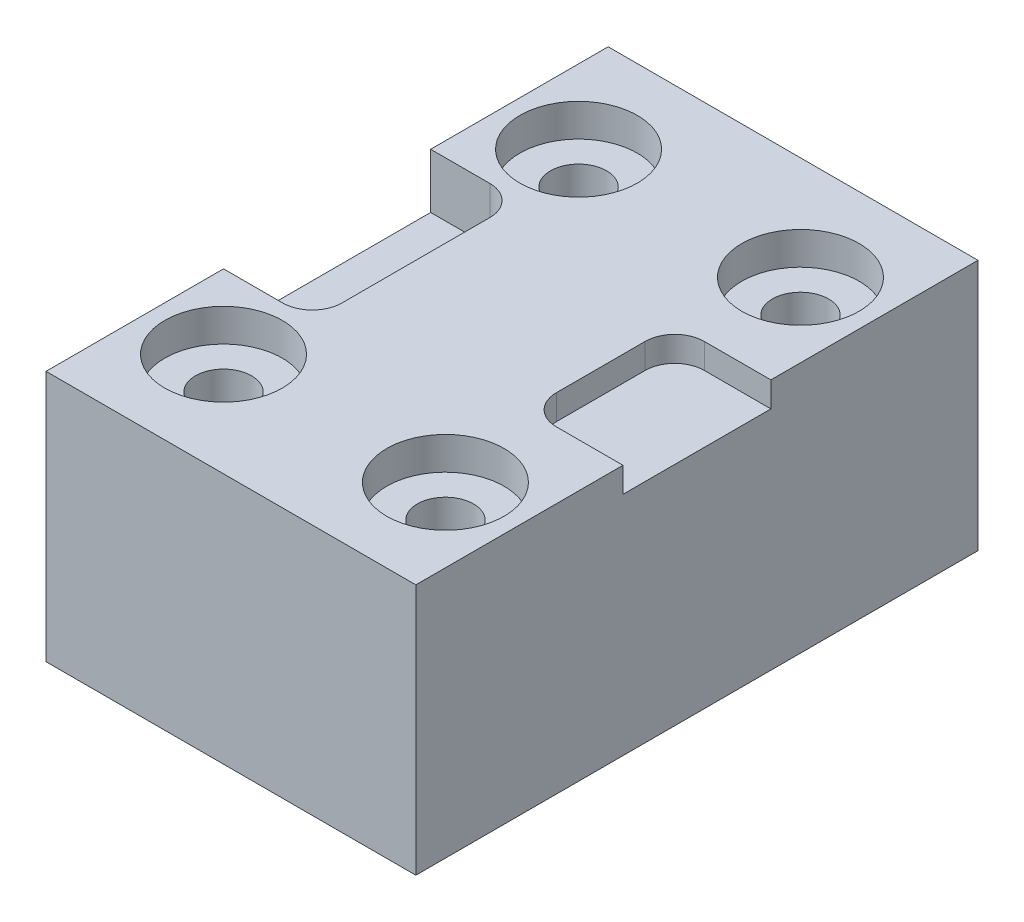
ISO-10303-21;
HEADER;
FILE_DESCRIPTION(('STEP AP214'),'2;1');
FILE_NAME('part.step','',(''),(''),'','','');
FILE_SCHEMA(('AUTOMOTIVE_DESIGN { 1 0 10303 214 1 1 1 1 }'));
ENDSEC;
DATA;
#1=APPLICATION_CONTEXT('core data for automotive mechanical design processes');
#2=APPLICATION_PROTOCOL_DEFINITION('international standard','automotive_design',2000,#1);
#3=PRODUCT_CONTEXT('',#1,'mechanical');
#4=PRODUCT('Part','Part','',(#3));
#5=PRODUCT_RELATED_PRODUCT_CATEGORY('part','',(#4));
#6=PRODUCT_DEFINITION_FORMATION('','',#4);
#7=PRODUCT_DEFINITION_CONTEXT('part definition',#1,'design');
#8=PRODUCT_DEFINITION('design','',#6,#7);
#9=PRODUCT_DEFINITION_SHAPE('','',#8);
#10=(LENGTH_UNIT() NAMED_UNIT(*) SI_UNIT(.MILLI.,.METRE.));
#11=(NAMED_UNIT(*) PLANE_ANGLE_UNIT() SI_UNIT($,.RADIAN.));
#12=(NAMED_UNIT(*) SI_UNIT($,.STERADIAN.) SOLID_ANGLE_UNIT());
#13=UNCERTAINTY_MEASURE_WITH_UNIT(LENGTH_MEASURE(1.E-05),#10,'distance_accuracy_value','');
#14=(GEOMETRIC_REPRESENTATION_CONTEXT(3) GLOBAL_UNCERTAINTY_ASSIGNED_CONTEXT((#13)) GLOBAL_UNIT_ASSIGNED_CONTEXT((#10,
#11,#12)) REPRESENTATION_CONTEXT('',''));
#15=CARTESIAN_POINT('',(0.,0.,0.));
#16=DIRECTION('',(0.,0.,1.));
#17=DIRECTION('',(1.,0.,0.));
#18=AXIS2_PLACEMENT_3D('',#15,#16,#17);
#19=CARTESIAN_POINT('',(-18493.9467312349,17.,-11317.191283293));
#20=DIRECTION('',(1.,0.,0.));
#21=DIRECTION('',(0.,0.,-1.));
#22=AXIS2_PLACEMENT_3D('',#19,#20,#21);
#23=PLANE('',#22);
#24=DIRECTION('',(0.,1.,0.));
#25=VECTOR('',#24,1.);
#26=CARTESIAN_POINT('',(-18493.9467312349,-15.2315462117273,-11291.191283293));
#27=LINE('',#26,#25);
#28=CARTESIAN_POINT('',(-18493.9467312349,13.3,-11291.191283293));
#29=VERTEX_POINT('',#28);
#30=CARTESIAN_POINT('',(-18493.9467312349,17.,-11291.191283293));
#31=VERTEX_POINT('',#30);
#32=EDGE_CURVE('E222',#29,#31,#27,.T.);
#33=ORIENTED_EDGE('',*,*,#32,.F.);
#34=DIRECTION('',(0.,0.,-1.));
#35=VECTOR('',#34,1.);
#36=CARTESIAN_POINT('',(-18493.9467312359,13.3,-1.72904467176498E-09));
#37=LINE('',#36,#35);
#38=CARTESIAN_POINT('',(-18493.9467312349,13.3,-11305.191283293));
#39=VERTEX_POINT('',#38);
#40=EDGE_CURVE('E199',#29,#39,#37,.T.);
#41=ORIENTED_EDGE('',*,*,#40,.T.);
#42=DIRECTION('',(0.,1.,0.));
#43=VECTOR('',#42,1.);
#44=CARTESIAN_POINT('',(-18493.9467312349,-15.2315462117273,-11305.191283293));
#45=LINE('',#44,#43);
#46=CARTESIAN_POINT('',(-18493.9467312349,17.,-11305.191283293));
#47=VERTEX_POINT('',#46);
#48=EDGE_CURVE('E224',#39,#47,#45,.T.);
#49=ORIENTED_EDGE('',*,*,#48,.T.);
#50=DIRECTION('',(0.,0.,1.));
#51=VECTOR('',#50,1.);
#52=CARTESIAN_POINT('',(-18493.9467312349,17.,-11317.191283293));
#53=LINE('',#52,#51);
#54=CARTESIAN_POINT('',(-18493.9467312349,17.,-11317.191283293));
#55=VERTEX_POINT('',#54);
#56=EDGE_CURVE('E234',#55,#47,#53,.T.);
#57=ORIENTED_EDGE('',*,*,#56,.F.);
#58=DIRECTION('',(0.,-1.,0.));
#59=VECTOR('',#58,1.);
#60=CARTESIAN_POINT('',(-18493.9467312349,17.,-11317.191283293));
#61=LINE('',#60,#59);
#62=CARTESIAN_POINT('',(-18493.9467312349,0.,-11317.191283293));
#63=VERTEX_POINT('',#62);
#64=EDGE_CURVE('E246',#55,#63,#61,.T.);
#65=ORIENTED_EDGE('',*,*,#64,.T.);
#66=DIRECTION('',(0.,0.,1.));
#67=VECTOR('',#66,1.);
#68=CARTESIAN_POINT('',(-18493.9467312349,0.,-11317.191283293));
#69=LINE('',#68,#67);
#70=CARTESIAN_POINT('',(-18493.9467312349,0.,-11279.191283293));
#71=VERTEX_POINT('',#70);
#72=EDGE_CURVE('E233',#63,#71,#69,.T.);
#73=ORIENTED_EDGE('',*,*,#72,.T.);
#74=DIRECTION('',(0.,-1.,0.));
#75=VECTOR('',#74,1.);
#76=CARTESIAN_POINT('',(-18493.9467312349,17.,-11279.191283293));
#77=LINE('',#76,#75);
#78=CARTESIAN_POINT('',(-18493.9467312349,17.,-11279.191283293));
#79=VERTEX_POINT('',#78);
#80=EDGE_CURVE('E12',#79,#71,#77,.T.);
#81=ORIENTED_EDGE('',*,*,#80,.F.);
#82=EDGE_CURVE('E238',#31,#79,#53,.T.);
#83=ORIENTED_EDGE('',*,*,#82,.F.);
#84=EDGE_LOOP('',(#33,#41,#49,#57,#65,#73,#81,#83));
#85=FACE_BOUND('',#84,.T.);
#86=ADVANCED_FACE('F36',(#85),#23,.F.);
#87=CARTESIAN_POINT('',(0.,17.,0.));
#88=DIRECTION('',(0.,1.,0.));
#89=DIRECTION('',(0.,0.,1.));
#90=AXIS2_PLACEMENT_3D('',#87,#88,#89);
#91=PLANE('',#90);
#92=CARTESIAN_POINT('',(-18488.9467312349,17.,-11310.191283293));
#93=DIRECTION('',(0.,1.,0.));
#94=DIRECTION('',(0.,0.,1.));
#95=AXIS2_PLACEMENT_3D('',#92,#93,#94);
#96=CIRCLE('',#95,3.96874999999852);
#97=CARTESIAN_POINT('',(-18488.9467312349,17.,-11306.222533293));
#98=VERTEX_POINT('',#97);
#99=EDGE_CURVE('E340',#98,#98,#96,.T.);
#100=ORIENTED_EDGE('',*,*,#99,.F.);
#101=EDGE_LOOP('',(#100));
#102=FACE_BOUND('',#101,.T.);
#103=CARTESIAN_POINT('',(-18473.9467312349,17.,-11310.191283293));
#104=DIRECTION('',(0.,1.,0.));
#105=DIRECTION('',(0.,0.,1.));
#106=AXIS2_PLACEMENT_3D('',#103,#104,#105);
#107=CIRCLE('',#106,3.96874999999852);
#108=CARTESIAN_POINT('',(-18473.9467312349,17.,-11306.222533293));
#109=VERTEX_POINT('',#108);
#110=EDGE_CURVE('E328',#109,#109,#107,.T.);
#111=ORIENTED_EDGE('',*,*,#110,.F.);
#112=EDGE_LOOP('',(#111));
#113=FACE_BOUND('',#112,.T.);
#114=CARTESIAN_POINT('',(-18473.9467312349,17.,-11286.191283293));
#115=DIRECTION('',(0.,1.,0.));
#116=DIRECTION('',(0.,0.,1.));
#117=AXIS2_PLACEMENT_3D('',#114,#115,#116);
#118=CIRCLE('',#117,3.96874999999852);
#119=CARTESIAN_POINT('',(-18473.9467312349,17.,-11282.222533293));
#120=VERTEX_POINT('',#119);
#121=EDGE_CURVE('E316',#120,#120,#118,.T.);
#122=ORIENTED_EDGE('',*,*,#121,.F.);
#123=EDGE_LOOP('',(#122));
#124=FACE_BOUND('',#123,.T.);
#125=CARTESIAN_POINT('',(-18488.9467312349,17.,-11286.191283293));
#126=DIRECTION('',(0.,1.,0.));
#127=DIRECTION('',(0.,0.,1.));
#128=AXIS2_PLACEMENT_3D('',#125,#126,#127);
#129=CIRCLE('',#128,3.96874999999852);
#130=CARTESIAN_POINT('',(-18488.9467312349,17.,-11282.222533293));
#131=VERTEX_POINT('',#130);
#132=EDGE_CURVE('E304',#131,#131,#129,.T.);
#133=ORIENTED_EDGE('',*,*,#132,.F.);
#134=EDGE_LOOP('',(#133));
#135=FACE_BOUND('',#134,.T.);
#136=DIRECTION('',(-1.,0.,-7.10542735758727E-13));
#137=VECTOR('',#136,1.);
#138=CARTESIAN_POINT('',(8.03140045722587E-09,17.,-11303.1912832799));
#139=LINE('',#138,#137);
#140=CARTESIAN_POINT('',(-18468.9467312349,17.,-11303.191283293));
#141=VERTEX_POINT('',#140);
#142=CARTESIAN_POINT('',(-18473.4467312349,17.,-11303.191283293));
#143=VERTEX_POINT('',#142);
#144=EDGE_CURVE('E164',#141,#143,#139,.T.);
#145=ORIENTED_EDGE('',*,*,#144,.F.);
#146=DIRECTION('',(0.,0.,-1.));
#147=VECTOR('',#146,1.);
#148=CARTESIAN_POINT('',(-18468.9467312349,17.,-11317.191283293));
#149=LINE('',#148,#147);
#150=CARTESIAN_POINT('',(-18468.9467312349,17.,-11317.191283293));
#151=VERTEX_POINT('',#150);
#152=EDGE_CURVE('E240',#141,#151,#149,.T.);
#153=ORIENTED_EDGE('',*,*,#152,.T.);
#154=DIRECTION('',(-1.,0.,0.));
#155=VECTOR('',#154,1.);
#156=CARTESIAN_POINT('',(-18493.9467312349,17.,-11317.191283293));
#157=LINE('',#156,#155);
#158=EDGE_CURVE('E244',#151,#55,#157,.T.);
#159=ORIENTED_EDGE('',*,*,#158,.T.);
#160=ORIENTED_EDGE('',*,*,#56,.T.);
#161=DIRECTION('',(-1.,0.,0.));
#162=VECTOR('',#161,1.);
#163=CARTESIAN_POINT('',(0.,17.,-11305.191283293));
#164=LINE('',#163,#162);
#165=CARTESIAN_POINT('',(-18489.9467312349,17.,-11305.191283293));
#166=VERTEX_POINT('',#165);
#167=EDGE_CURVE('E215',#166,#47,#164,.T.);
#168=ORIENTED_EDGE('',*,*,#167,.F.);
#169=CARTESIAN_POINT('',(-18489.9467312349,17.,-11303.191283293));
#170=DIRECTION('',(0.,1.,0.));
#171=DIRECTION('',(0.,0.,1.));
#172=AXIS2_PLACEMENT_3D('',#169,#170,#171);
#173=CIRCLE('',#172,1.99999999999978);
#174=CARTESIAN_POINT('',(-18487.9467312349,17.,-11303.191283293));
#175=VERTEX_POINT('',#174);
#176=EDGE_CURVE('E212',#175,#166,#173,.T.);
#177=ORIENTED_EDGE('',*,*,#176,.F.);
#178=DIRECTION('',(0.,0.,-1.));
#179=VECTOR('',#178,1.);
#180=CARTESIAN_POINT('',(-18487.9467312349,17.,0.));
#181=LINE('',#180,#179);
#182=CARTESIAN_POINT('',(-18487.9467312349,17.,-11293.191283293));
#183=VERTEX_POINT('',#182);
#184=EDGE_CURVE('E209',#183,#175,#181,.T.);
#185=ORIENTED_EDGE('',*,*,#184,.F.);
#186=CARTESIAN_POINT('',(-18489.9467312349,17.,-11293.191283293));
#187=DIRECTION('',(0.,1.,0.));
#188=DIRECTION('',(0.,0.,1.));
#189=AXIS2_PLACEMENT_3D('',#186,#187,#188);
#190=CIRCLE('',#189,1.99999999999978);
#191=CARTESIAN_POINT('',(-18489.9467312349,17.,-11291.191283293));
#192=VERTEX_POINT('',#191);
#193=EDGE_CURVE('E58',#192,#183,#190,.T.);
#194=ORIENTED_EDGE('',*,*,#193,.F.);
#195=DIRECTION('',(-1.,0.,0.));
#196=VECTOR('',#195,1.);
#197=CARTESIAN_POINT('',(0.,17.,-11291.191283293));
#198=LINE('',#197,#196);
#199=EDGE_CURVE('E217',#192,#31,#198,.T.);
#200=ORIENTED_EDGE('',*,*,#199,.T.);
#201=ORIENTED_EDGE('',*,*,#82,.T.);
#202=DIRECTION('',(1.,0.,0.));
#203=VECTOR('',#202,1.);
#204=CARTESIAN_POINT('',(-18493.9467312349,17.,-11279.191283293));
#205=LINE('',#204,#203);
#206=CARTESIAN_POINT('',(-18468.9467312349,17.,-11279.191283293));
#207=VERTEX_POINT('',#206);
#208=EDGE_CURVE('E237',#79,#207,#205,.T.);
#209=ORIENTED_EDGE('',*,*,#208,.T.);
#210=CARTESIAN_POINT('',(-18468.9467312349,17.,-11293.191283293));
#211=VERTEX_POINT('',#210);
#212=EDGE_CURVE('E241',#207,#211,#149,.T.);
#213=ORIENTED_EDGE('',*,*,#212,.T.);
#214=DIRECTION('',(-1.,0.,-7.10542735759737E-13));
#215=VECTOR('',#214,1.);
#216=CARTESIAN_POINT('',(8.02429502987968E-09,17.,-11293.1912832799));
#217=LINE('',#216,#215);
#218=CARTESIAN_POINT('',(-18473.4467312349,17.,-11293.191283293));
#219=VERTEX_POINT('',#218);
#220=EDGE_CURVE('E161',#211,#219,#217,.T.);
#221=ORIENTED_EDGE('',*,*,#220,.T.);
#222=CARTESIAN_POINT('',(-18473.4467312349,17.,-11295.191283293));
#223=DIRECTION('',(0.,1.,0.));
#224=DIRECTION('',(0.,0.,1.));
#225=AXIS2_PLACEMENT_3D('',#222,#223,#224);
#226=CIRCLE('',#225,2.00000000000156);
#227=CARTESIAN_POINT('',(-18475.4467312349,17.,-11295.191283293));
#228=VERTEX_POINT('',#227);
#229=EDGE_CURVE('E177',#219,#228,#226,.F.);
#230=ORIENTED_EDGE('',*,*,#229,.T.);
#231=DIRECTION('',(5.92118946466728E-13,0.,-1.));
#232=VECTOR('',#231,1.);
#233=CARTESIAN_POINT('',(-18475.4467312416,17.,-1.09396620540049E-08));
#234=LINE('',#233,#232);
#235=CARTESIAN_POINT('',(-18475.4467312349,17.,-11301.191283293));
#236=VERTEX_POINT('',#235);
#237=EDGE_CURVE('E175',#228,#236,#234,.T.);
#238=ORIENTED_EDGE('',*,*,#237,.T.);
#239=CARTESIAN_POINT('',(-18473.4467312349,17.,-11301.191283293));
#240=DIRECTION('',(0.,1.,0.));
#241=DIRECTION('',(0.,0.,1.));
#242=AXIS2_PLACEMENT_3D('',#239,#240,#241);
#243=CIRCLE('',#242,2.00000000000067);
#244=EDGE_CURVE('E154',#143,#236,#243,.T.);
#245=ORIENTED_EDGE('',*,*,#244,.F.);
#246=EDGE_LOOP('',(#145,#153,#159,#160,#168,#177,#185,#194,#200,#201,#209,#213,#221,#230,#238,#245));
#247=FACE_BOUND('',#246,.T.);
#248=ADVANCED_FACE('F172',(#102,#113,#124,#135,#247),#91,.T.);
#249=CARTESIAN_POINT('',(-18493.9467312349,17.,-11279.191283293));
#250=DIRECTION('',(0.,0.,-1.));
#251=DIRECTION('',(-1.,0.,0.));
#252=AXIS2_PLACEMENT_3D('',#249,#250,#251);
#253=PLANE('',#252);
#254=DIRECTION('',(1.,0.,0.));
#255=VECTOR('',#254,1.);
#256=CARTESIAN_POINT('',(-18493.9467312349,0.,-11279.191283293));
#257=LINE('',#256,#255);
#258=CARTESIAN_POINT('',(-18468.9467312349,0.,-11279.191283293));
#259=VERTEX_POINT('',#258);
#260=EDGE_CURVE('E249',#71,#259,#257,.T.);
#261=ORIENTED_EDGE('',*,*,#260,.T.);
#262=DIRECTION('',(0.,-1.,0.));
#263=VECTOR('',#262,1.);
#264=CARTESIAN_POINT('',(-18468.9467312349,17.,-11279.191283293));
#265=LINE('',#264,#263);
#266=EDGE_CURVE('E43',#207,#259,#265,.T.);
#267=ORIENTED_EDGE('',*,*,#266,.F.);
#268=ORIENTED_EDGE('',*,*,#208,.F.);
#269=ORIENTED_EDGE('',*,*,#80,.T.);
#270=EDGE_LOOP('',(#261,#267,#268,#269));
#271=FACE_BOUND('',#270,.T.);
#272=ADVANCED_FACE('F348',(#271),#253,.F.);
#273=CARTESIAN_POINT('',(-18468.9467312349,17.,-11317.191283293));
#274=DIRECTION('',(-1.,0.,0.));
#275=DIRECTION('',(0.,0.,1.));
#276=AXIS2_PLACEMENT_3D('',#273,#274,#275);
#277=PLANE('',#276);
#278=ORIENTED_EDGE('',*,*,#152,.F.);
#279=DIRECTION('',(0.,1.,0.));
#280=VECTOR('',#279,1.);
#281=CARTESIAN_POINT('',(-18468.9467312349,-11.9268604418842,-11303.191283293));
#282=LINE('',#281,#280);
#283=CARTESIAN_POINT('',(-18468.9467312349,15.3,-11303.191283293));
#284=VERTEX_POINT('',#283);
#285=EDGE_CURVE('E167',#284,#141,#282,.T.);
#286=ORIENTED_EDGE('',*,*,#285,.F.);
#287=DIRECTION('',(0.,0.,1.));
#288=VECTOR('',#287,1.);
#289=CARTESIAN_POINT('',(-18468.9467312349,15.3,0.));
#290=LINE('',#289,#288);
#291=CARTESIAN_POINT('',(-18468.9467312349,15.3,-11293.191283293));
#292=VERTEX_POINT('',#291);
#293=EDGE_CURVE('E285',#284,#292,#290,.T.);
#294=ORIENTED_EDGE('',*,*,#293,.T.);
#295=DIRECTION('',(0.,1.,0.));
#296=VECTOR('',#295,1.);
#297=CARTESIAN_POINT('',(-18468.9467312349,-11.9268604418842,-11293.191283293));
#298=LINE('',#297,#296);
#299=EDGE_CURVE('E50',#292,#211,#298,.T.);
#300=ORIENTED_EDGE('',*,*,#299,.T.);
#301=ORIENTED_EDGE('',*,*,#212,.F.);
#302=ORIENTED_EDGE('',*,*,#266,.T.);
#303=DIRECTION('',(0.,0.,-1.));
#304=VECTOR('',#303,1.);
#305=CARTESIAN_POINT('',(-18468.9467312349,0.,-11317.191283293));
#306=LINE('',#305,#304);
#307=CARTESIAN_POINT('',(-18468.9467312349,0.,-11317.191283293));
#308=VERTEX_POINT('',#307);
#309=EDGE_CURVE('E251',#259,#308,#306,.T.);
#310=ORIENTED_EDGE('',*,*,#309,.T.);
#311=DIRECTION('',(0.,-1.,0.));
#312=VECTOR('',#311,1.);
#313=CARTESIAN_POINT('',(-18468.9467312349,17.,-11317.191283293));
#314=LINE('',#313,#312);
#315=EDGE_CURVE('E257',#151,#308,#314,.T.);
#316=ORIENTED_EDGE('',*,*,#315,.F.);
#317=EDGE_LOOP('',(#278,#286,#294,#300,#301,#302,#310,#316));
#318=FACE_BOUND('',#317,.T.);
#319=ADVANCED_FACE('F264',(#318),#277,.F.);
#320=CARTESIAN_POINT('',(-18493.9467312349,17.,-11317.191283293));
#321=DIRECTION('',(0.,0.,1.));
#322=DIRECTION('',(1.,0.,0.));
#323=AXIS2_PLACEMENT_3D('',#320,#321,#322);
#324=PLANE('',#323);
#325=DIRECTION('',(-1.,0.,0.));
#326=VECTOR('',#325,1.);
#327=CARTESIAN_POINT('',(-18493.9467312349,0.,-11317.191283293));
#328=LINE('',#327,#326);
#329=EDGE_CURVE('E253',#308,#63,#328,.T.);
#330=ORIENTED_EDGE('',*,*,#329,.T.);
#331=ORIENTED_EDGE('',*,*,#64,.F.);
#332=ORIENTED_EDGE('',*,*,#158,.F.);
#333=ORIENTED_EDGE('',*,*,#315,.T.);
#334=EDGE_LOOP('',(#330,#331,#332,#333));
#335=FACE_BOUND('',#334,.T.);
#336=ADVANCED_FACE('F274',(#335),#324,.F.);
#337=CARTESIAN_POINT('',(0.,0.,0.));
#338=DIRECTION('',(0.,1.,0.));
#339=DIRECTION('',(0.,0.,1.));
#340=AXIS2_PLACEMENT_3D('',#337,#338,#339);
#341=PLANE('',#340);
#342=CARTESIAN_POINT('',(-18488.9467312349,0.,-11310.191283293));
#343=DIRECTION('',(0.,1.,0.));
#344=DIRECTION('',(0.,0.,1.));
#345=AXIS2_PLACEMENT_3D('',#342,#343,#344);
#346=CIRCLE('',#345,1.89865000000111);
#347=CARTESIAN_POINT('',(-18488.9467312349,0.,-11308.292633293));
#348=VERTEX_POINT('',#347);
#349=EDGE_CURVE('E331',#348,#348,#346,.T.);
#350=ORIENTED_EDGE('',*,*,#349,.T.);
#351=EDGE_LOOP('',(#350));
#352=FACE_BOUND('',#351,.T.);
#353=CARTESIAN_POINT('',(-18473.9467312349,0.,-11310.191283293));
#354=DIRECTION('',(0.,1.,0.));
#355=DIRECTION('',(0.,0.,1.));
#356=AXIS2_PLACEMENT_3D('',#353,#354,#355);
#357=CIRCLE('',#356,1.89865000000111);
#358=CARTESIAN_POINT('',(-18473.9467312349,0.,-11308.292633293));
#359=VERTEX_POINT('',#358);
#360=EDGE_CURVE('E319',#359,#359,#357,.T.);
#361=ORIENTED_EDGE('',*,*,#360,.T.);
#362=EDGE_LOOP('',(#361));
#363=FACE_BOUND('',#362,.T.);
#364=CARTESIAN_POINT('',(-18473.9467312349,0.,-11286.191283293));
#365=DIRECTION('',(0.,1.,0.));
#366=DIRECTION('',(0.,0.,1.));
#367=AXIS2_PLACEMENT_3D('',#364,#365,#366);
#368=CIRCLE('',#367,1.89865000000111);
#369=CARTESIAN_POINT('',(-18473.9467312349,0.,-11284.292633293));
#370=VERTEX_POINT('',#369);
#371=EDGE_CURVE('E307',#370,#370,#368,.T.);
#372=ORIENTED_EDGE('',*,*,#371,.T.);
#373=EDGE_LOOP('',(#372));
#374=FACE_BOUND('',#373,.T.);
#375=CARTESIAN_POINT('',(-18488.9467312349,0.,-11286.191283293));
#376=DIRECTION('',(0.,1.,0.));
#377=DIRECTION('',(0.,0.,1.));
#378=AXIS2_PLACEMENT_3D('',#375,#376,#377);
#379=CIRCLE('',#378,1.89865000000111);
#380=CARTESIAN_POINT('',(-18488.9467312349,0.,-11284.292633293));
#381=VERTEX_POINT('',#380);
#382=EDGE_CURVE('E170',#381,#381,#379,.T.);
#383=ORIENTED_EDGE('',*,*,#382,.T.);
#384=EDGE_LOOP('',(#383));
#385=FACE_BOUND('',#384,.T.);
#386=ORIENTED_EDGE('',*,*,#72,.F.);
#387=ORIENTED_EDGE('',*,*,#329,.F.);
#388=ORIENTED_EDGE('',*,*,#309,.F.);
#389=ORIENTED_EDGE('',*,*,#260,.F.);
#390=EDGE_LOOP('',(#386,#387,#388,#389));
#391=FACE_BOUND('',#390,.T.);
#392=ADVANCED_FACE('F271',(#352,#363,#374,#385,#391),#341,.F.);
#393=CARTESIAN_POINT('',(-18489.9467312349,-15.2315462117273,-11293.191283293));
#394=DIRECTION('',(0.,1.,0.));
#395=DIRECTION('',(0.,0.,1.));
#396=AXIS2_PLACEMENT_3D('',#393,#394,#395);
#397=CYLINDRICAL_SURFACE('',#396,1.99999999999978);
#398=CARTESIAN_POINT('',(-18489.9467312349,13.3,-11293.191283293));
#399=DIRECTION('',(0.,1.,0.));
#400=DIRECTION('',(0.,0.,1.));
#401=AXIS2_PLACEMENT_3D('',#398,#399,#400);
#402=CIRCLE('',#401,1.99999999999978);
#403=CARTESIAN_POINT('',(-18487.9467312349,13.3,-11293.191283293));
#404=VERTEX_POINT('',#403);
#405=CARTESIAN_POINT('',(-18489.9467312349,13.3,-11291.191283293));
#406=VERTEX_POINT('',#405);
#407=EDGE_CURVE('E205',#404,#406,#402,.F.);
#408=ORIENTED_EDGE('',*,*,#407,.T.);
#409=DIRECTION('',(0.,1.,0.));
#410=VECTOR('',#409,1.);
#411=CARTESIAN_POINT('',(-18489.9467312349,-15.2315462117273,-11291.191283293));
#412=LINE('',#411,#410);
#413=EDGE_CURVE('E197',#406,#192,#412,.T.);
#414=ORIENTED_EDGE('',*,*,#413,.T.);
#415=ORIENTED_EDGE('',*,*,#193,.T.);
#416=DIRECTION('',(0.,1.,0.));
#417=VECTOR('',#416,1.);
#418=CARTESIAN_POINT('',(-18487.9467312349,-15.2315462117273,-11293.191283293));
#419=LINE('',#418,#417);
#420=EDGE_CURVE('E220',#404,#183,#419,.T.);
#421=ORIENTED_EDGE('',*,*,#420,.F.);
#422=EDGE_LOOP('',(#408,#414,#415,#421));
#423=FACE_BOUND('',#422,.T.);
#424=ADVANCED_FACE('F407',(#423),#397,.F.);
#425=CARTESIAN_POINT('',(0.,-15.2315462117273,-11291.191283293));
#426=DIRECTION('',(0.,0.,-1.));
#427=DIRECTION('',(-1.,0.,0.));
#428=AXIS2_PLACEMENT_3D('',#425,#426,#427);
#429=PLANE('',#428);
#430=ORIENTED_EDGE('',*,*,#32,.T.);
#431=ORIENTED_EDGE('',*,*,#199,.F.);
#432=ORIENTED_EDGE('',*,*,#413,.F.);
#433=DIRECTION('',(1.,0.,0.));
#434=VECTOR('',#433,1.);
#435=CARTESIAN_POINT('',(0.,13.3,-11291.191283293));
#436=LINE('',#435,#434);
#437=EDGE_CURVE('E202',#29,#406,#436,.T.);
#438=ORIENTED_EDGE('',*,*,#437,.F.);
#439=EDGE_LOOP('',(#430,#431,#432,#438));
#440=FACE_BOUND('',#439,.T.);
#441=ADVANCED_FACE('F415',(#440),#429,.T.);
#442=CARTESIAN_POINT('',(0.,-15.2315462117273,-11305.191283293));
#443=DIRECTION('',(0.,0.,-1.));
#444=DIRECTION('',(-1.,0.,0.));
#445=AXIS2_PLACEMENT_3D('',#442,#443,#444);
#446=PLANE('',#445);
#447=DIRECTION('',(1.,0.,0.));
#448=VECTOR('',#447,1.);
#449=CARTESIAN_POINT('',(0.,13.3,-11305.191283293));
#450=LINE('',#449,#448);
#451=CARTESIAN_POINT('',(-18489.9467312349,13.3,-11305.191283293));
#452=VERTEX_POINT('',#451);
#453=EDGE_CURVE('E196',#39,#452,#450,.T.);
#454=ORIENTED_EDGE('',*,*,#453,.T.);
#455=DIRECTION('',(0.,1.,0.));
#456=VECTOR('',#455,1.);
#457=CARTESIAN_POINT('',(-18489.9467312349,-15.2315462117273,-11305.191283293));
#458=LINE('',#457,#456);
#459=EDGE_CURVE('E227',#452,#166,#458,.T.);
#460=ORIENTED_EDGE('',*,*,#459,.T.);
#461=ORIENTED_EDGE('',*,*,#167,.T.);
#462=ORIENTED_EDGE('',*,*,#48,.F.);
#463=EDGE_LOOP('',(#454,#460,#461,#462));
#464=FACE_BOUND('',#463,.T.);
#465=ADVANCED_FACE('F422',(#464),#446,.F.);
#466=CARTESIAN_POINT('',(-18489.9467312349,-15.2315462117273,-11303.191283293));
#467=DIRECTION('',(0.,1.,0.));
#468=DIRECTION('',(0.,0.,1.));
#469=AXIS2_PLACEMENT_3D('',#466,#467,#468);
#470=CYLINDRICAL_SURFACE('',#469,1.99999999999978);
#471=CARTESIAN_POINT('',(-18489.9467312349,13.3,-11303.191283293));
#472=DIRECTION('',(0.,1.,0.));
#473=DIRECTION('',(0.,0.,1.));
#474=AXIS2_PLACEMENT_3D('',#471,#472,#473);
#475=CIRCLE('',#474,1.99999999999978);
#476=CARTESIAN_POINT('',(-18487.9467312349,13.3,-11303.191283293));
#477=VERTEX_POINT('',#476);
#478=EDGE_CURVE('E194',#452,#477,#475,.F.);
#479=ORIENTED_EDGE('',*,*,#478,.T.);
#480=DIRECTION('',(0.,1.,0.));
#481=VECTOR('',#480,1.);
#482=CARTESIAN_POINT('',(-18487.9467312349,-15.2315462117273,-11303.191283293));
#483=LINE('',#482,#481);
#484=EDGE_CURVE('E229',#477,#175,#483,.T.);
#485=ORIENTED_EDGE('',*,*,#484,.T.);
#486=ORIENTED_EDGE('',*,*,#176,.T.);
#487=ORIENTED_EDGE('',*,*,#459,.F.);
#488=EDGE_LOOP('',(#479,#485,#486,#487));
#489=FACE_BOUND('',#488,.T.);
#490=ADVANCED_FACE('F430',(#489),#470,.F.);
#491=CARTESIAN_POINT('',(-18487.9467312349,-15.2315462117273,0.));
#492=DIRECTION('',(1.,0.,0.));
#493=DIRECTION('',(0.,0.,-1.));
#494=AXIS2_PLACEMENT_3D('',#491,#492,#493);
#495=PLANE('',#494);
#496=DIRECTION('',(0.,0.,1.));
#497=VECTOR('',#496,1.);
#498=CARTESIAN_POINT('',(-18487.9467312349,13.3,0.));
#499=LINE('',#498,#497);
#500=EDGE_CURVE('E207',#477,#404,#499,.T.);
#501=ORIENTED_EDGE('',*,*,#500,.T.);
#502=ORIENTED_EDGE('',*,*,#420,.T.);
#503=ORIENTED_EDGE('',*,*,#184,.T.);
#504=ORIENTED_EDGE('',*,*,#484,.F.);
#505=EDGE_LOOP('',(#501,#502,#503,#504));
#506=FACE_BOUND('',#505,.T.);
#507=ADVANCED_FACE('F438',(#506),#495,.F.);
#508=CARTESIAN_POINT('',(0.,13.3,0.));
#509=DIRECTION('',(0.,1.,0.));
#510=DIRECTION('',(0.,0.,1.));
#511=AXIS2_PLACEMENT_3D('',#508,#509,#510);
#512=PLANE('',#511);
#513=ORIENTED_EDGE('',*,*,#407,.F.);
#514=ORIENTED_EDGE('',*,*,#500,.F.);
#515=ORIENTED_EDGE('',*,*,#478,.F.);
#516=ORIENTED_EDGE('',*,*,#453,.F.);
#517=ORIENTED_EDGE('',*,*,#40,.F.);
#518=ORIENTED_EDGE('',*,*,#437,.T.);
#519=EDGE_LOOP('',(#513,#514,#515,#516,#517,#518));
#520=FACE_BOUND('',#519,.T.);
#521=ADVANCED_FACE('F446',(#520),#512,.T.);
#522=CARTESIAN_POINT('',(8.03140045722587E-09,-11.9268604418842,-11303.1912832799));
#523=DIRECTION('',(7.10542735758727E-13,0.,-1.));
#524=DIRECTION('',(-1.,0.,-7.10542735758727E-13));
#525=AXIS2_PLACEMENT_3D('',#522,#523,#524);
#526=PLANE('',#525);
#527=DIRECTION('',(1.,0.,7.10542735758727E-13));
#528=VECTOR('',#527,1.);
#529=CARTESIAN_POINT('',(8.03140045722587E-09,15.3,-11303.1912832799));
#530=LINE('',#529,#528);
#531=CARTESIAN_POINT('',(-18473.4467312349,15.3,-11303.191283293));
#532=VERTEX_POINT('',#531);
#533=EDGE_CURVE('E193',#532,#284,#530,.T.);
#534=ORIENTED_EDGE('',*,*,#533,.T.);
#535=ORIENTED_EDGE('',*,*,#285,.T.);
#536=ORIENTED_EDGE('',*,*,#144,.T.);
#537=DIRECTION('',(0.,1.,0.));
#538=VECTOR('',#537,1.);
#539=CARTESIAN_POINT('',(-18473.4467312349,-11.9268604418842,-11303.191283293));
#540=LINE('',#539,#538);
#541=EDGE_CURVE('E149',#532,#143,#540,.T.);
#542=ORIENTED_EDGE('',*,*,#541,.F.);
#543=EDGE_LOOP('',(#534,#535,#536,#542));
#544=FACE_BOUND('',#543,.T.);
#545=ADVANCED_FACE('F165',(#544),#526,.F.);
#546=CARTESIAN_POINT('',(8.02429502987968E-09,-11.9268604418842,-11293.1912832799));
#547=DIRECTION('',(7.10542735759737E-13,0.,-1.));
#548=DIRECTION('',(-1.,0.,-7.10542735759737E-13));
#549=AXIS2_PLACEMENT_3D('',#546,#547,#548);
#550=PLANE('',#549);
#551=DIRECTION('',(0.,1.,0.));
#552=VECTOR('',#551,1.);
#553=CARTESIAN_POINT('',(-18473.4467312349,-11.9268604418842,-11293.191283293));
#554=LINE('',#553,#552);
#555=CARTESIAN_POINT('',(-18473.4467312349,15.3,-11293.191283293));
#556=VERTEX_POINT('',#555);
#557=EDGE_CURVE('E187',#556,#219,#554,.T.);
#558=ORIENTED_EDGE('',*,*,#557,.T.);
#559=ORIENTED_EDGE('',*,*,#220,.F.);
#560=ORIENTED_EDGE('',*,*,#299,.F.);
#561=DIRECTION('',(1.,0.,7.10542735759737E-13));
#562=VECTOR('',#561,1.);
#563=CARTESIAN_POINT('',(8.02429502987968E-09,15.3,-11293.1912832799));
#564=LINE('',#563,#562);
#565=EDGE_CURVE('E287',#556,#292,#564,.T.);
#566=ORIENTED_EDGE('',*,*,#565,.F.);
#567=EDGE_LOOP('',(#558,#559,#560,#566));
#568=FACE_BOUND('',#567,.T.);
#569=ADVANCED_FACE('F459',(#568),#550,.T.);
#570=CARTESIAN_POINT('',(-18473.4467312349,-11.9268604418842,-11295.191283293));
#571=DIRECTION('',(0.,1.,0.));
#572=DIRECTION('',(0.,0.,1.));
#573=AXIS2_PLACEMENT_3D('',#570,#571,#572);
#574=CYLINDRICAL_SURFACE('',#573,2.00000000000156);
#575=DIRECTION('',(0.,1.,0.));
#576=VECTOR('',#575,1.);
#577=CARTESIAN_POINT('',(-18475.4467312349,-11.9268604418842,-11295.191283293));
#578=LINE('',#577,#576);
#579=CARTESIAN_POINT('',(-18475.4467312349,15.3,-11295.191283293));
#580=VERTEX_POINT('',#579);
#581=EDGE_CURVE('E189',#580,#228,#578,.T.);
#582=ORIENTED_EDGE('',*,*,#581,.T.);
#583=ORIENTED_EDGE('',*,*,#229,.F.);
#584=ORIENTED_EDGE('',*,*,#557,.F.);
#585=CARTESIAN_POINT('',(-18473.4467312349,15.3,-11295.191283293));
#586=DIRECTION('',(0.,1.,0.));
#587=DIRECTION('',(0.,0.,1.));
#588=AXIS2_PLACEMENT_3D('',#585,#586,#587);
#589=CIRCLE('',#588,2.00000000000156);
#590=EDGE_CURVE('E289',#580,#556,#589,.T.);
#591=ORIENTED_EDGE('',*,*,#590,.F.);
#592=EDGE_LOOP('',(#582,#583,#584,#591));
#593=FACE_BOUND('',#592,.T.);
#594=ADVANCED_FACE('F466',(#593),#574,.F.);
#595=CARTESIAN_POINT('',(-18475.4467312416,-11.9268604418842,-1.09396620540049E-08));
#596=DIRECTION('',(1.,0.,5.92118946466728E-13));
#597=DIRECTION('',(5.92118946466728E-13,0.,-1.));
#598=AXIS2_PLACEMENT_3D('',#595,#596,#597);
#599=PLANE('',#598);
#600=DIRECTION('',(0.,1.,0.));
#601=VECTOR('',#600,1.);
#602=CARTESIAN_POINT('',(-18475.4467312349,-11.9268604418842,-11301.191283293));
#603=LINE('',#602,#601);
#604=CARTESIAN_POINT('',(-18475.4467312349,15.3,-11301.191283293));
#605=VERTEX_POINT('',#604);
#606=EDGE_CURVE('E160',#605,#236,#603,.T.);
#607=ORIENTED_EDGE('',*,*,#606,.T.);
#608=ORIENTED_EDGE('',*,*,#237,.F.);
#609=ORIENTED_EDGE('',*,*,#581,.F.);
#610=DIRECTION('',(-5.92118946466728E-13,0.,1.));
#611=VECTOR('',#610,1.);
#612=CARTESIAN_POINT('',(-18475.4467312416,15.3,-1.09396620540049E-08));
#613=LINE('',#612,#611);
#614=EDGE_CURVE('E185',#605,#580,#613,.T.);
#615=ORIENTED_EDGE('',*,*,#614,.F.);
#616=EDGE_LOOP('',(#607,#608,#609,#615));
#617=FACE_BOUND('',#616,.T.);
#618=ADVANCED_FACE('F473',(#617),#599,.T.);
#619=CARTESIAN_POINT('',(-18473.4467312349,-11.9268604418842,-11301.191283293));
#620=DIRECTION('',(0.,1.,0.));
#621=DIRECTION('',(0.,0.,1.));
#622=AXIS2_PLACEMENT_3D('',#619,#620,#621);
#623=CYLINDRICAL_SURFACE('',#622,2.00000000000067);
#624=CARTESIAN_POINT('',(-18473.4467312349,15.3,-11301.191283293));
#625=DIRECTION('',(0.,1.,0.));
#626=DIRECTION('',(0.,0.,1.));
#627=AXIS2_PLACEMENT_3D('',#624,#625,#626);
#628=CIRCLE('',#627,2.00000000000067);
#629=EDGE_CURVE('E157',#605,#532,#628,.F.);
#630=ORIENTED_EDGE('',*,*,#629,.T.);
#631=ORIENTED_EDGE('',*,*,#541,.T.);
#632=ORIENTED_EDGE('',*,*,#244,.T.);
#633=ORIENTED_EDGE('',*,*,#606,.F.);
#634=EDGE_LOOP('',(#630,#631,#632,#633));
#635=FACE_BOUND('',#634,.T.);
#636=ADVANCED_FACE('F151',(#635),#623,.F.);
#637=CARTESIAN_POINT('',(0.,15.3,0.));
#638=DIRECTION('',(0.,1.,0.));
#639=DIRECTION('',(0.,0.,1.));
#640=AXIS2_PLACEMENT_3D('',#637,#638,#639);
#641=PLANE('',#640);
#642=ORIENTED_EDGE('',*,*,#533,.F.);
#643=ORIENTED_EDGE('',*,*,#629,.F.);
#644=ORIENTED_EDGE('',*,*,#614,.T.);
#645=ORIENTED_EDGE('',*,*,#590,.T.);
#646=ORIENTED_EDGE('',*,*,#565,.T.);
#647=ORIENTED_EDGE('',*,*,#293,.F.);
#648=EDGE_LOOP('',(#642,#643,#644,#645,#646,#647));
#649=FACE_BOUND('',#648,.T.);
#650=ADVANCED_FACE('F488',(#649),#641,.T.);
#651=CARTESIAN_POINT('',(-18488.9467312349,17.,-11286.191283293));
#652=DIRECTION('',(0.,1.,0.));
#653=DIRECTION('',(0.,0.,1.));
#654=AXIS2_PLACEMENT_3D('',#651,#652,#653);
#655=CYLINDRICAL_SURFACE('',#654,1.89865000000111);
#656=ORIENTED_EDGE('',*,*,#382,.F.);
#657=EDGE_LOOP('',(#656));
#658=FACE_BOUND('',#657,.T.);
#659=CARTESIAN_POINT('',(-18488.9467312349,14.7902,-11286.191283293));
#660=DIRECTION('',(0.,1.,0.));
#661=DIRECTION('',(0.,0.,1.));
#662=AXIS2_PLACEMENT_3D('',#659,#660,#661);
#663=CIRCLE('',#662,1.89865000000111);
#664=CARTESIAN_POINT('',(-18488.9467312349,14.7902,-11284.292633293));
#665=VERTEX_POINT('',#664);
#666=EDGE_CURVE('E298',#665,#665,#663,.T.);
#667=ORIENTED_EDGE('',*,*,#666,.T.);
#668=EDGE_LOOP('',(#667));
#669=FACE_BOUND('',#668,.T.);
#670=ADVANCED_FACE('F369',(#658,#669),#655,.F.);
#671=CARTESIAN_POINT('',(-18487.0480812349,14.7902,-11286.191283293));
#672=DIRECTION('',(0.,-1.,0.));
#673=DIRECTION('',(0.,0.,-1.));
#674=AXIS2_PLACEMENT_3D('',#671,#672,#673);
#675=PLANE('',#674);
#676=ORIENTED_EDGE('',*,*,#666,.F.);
#677=EDGE_LOOP('',(#676));
#678=FACE_BOUND('',#677,.T.);
#679=CARTESIAN_POINT('',(-18488.9467312349,14.7902,-11286.191283293));
#680=DIRECTION('',(0.,1.,0.));
#681=DIRECTION('',(0.,0.,1.));
#682=AXIS2_PLACEMENT_3D('',#679,#680,#681);
#683=CIRCLE('',#682,3.96874999999852);
#684=CARTESIAN_POINT('',(-18488.9467312349,14.7902,-11282.222533293));
#685=VERTEX_POINT('',#684);
#686=EDGE_CURVE('E301',#685,#685,#683,.T.);
#687=ORIENTED_EDGE('',*,*,#686,.T.);
#688=EDGE_LOOP('',(#687));
#689=FACE_BOUND('',#688,.T.);
#690=ADVANCED_FACE('F359',(#678,#689),#675,.F.);
#691=CARTESIAN_POINT('',(-18488.9467312349,17.,-11286.191283293));
#692=DIRECTION('',(0.,1.,0.));
#693=DIRECTION('',(0.,0.,1.));
#694=AXIS2_PLACEMENT_3D('',#691,#692,#693);
#695=CYLINDRICAL_SURFACE('',#694,3.96874999999852);
#696=ORIENTED_EDGE('',*,*,#686,.F.);
#697=EDGE_LOOP('',(#696));
#698=FACE_BOUND('',#697,.T.);
#699=ORIENTED_EDGE('',*,*,#132,.T.);
#700=EDGE_LOOP('',(#699));
#701=FACE_BOUND('',#700,.T.);
#702=ADVANCED_FACE('F356',(#698,#701),#695,.F.);
#703=CARTESIAN_POINT('',(-18473.9467312349,17.,-11286.191283293));
#704=DIRECTION('',(0.,1.,0.));
#705=DIRECTION('',(0.,0.,1.));
#706=AXIS2_PLACEMENT_3D('',#703,#704,#705);
#707=CYLINDRICAL_SURFACE('',#706,1.89865000000111);
#708=ORIENTED_EDGE('',*,*,#371,.F.);
#709=EDGE_LOOP('',(#708));
#710=FACE_BOUND('',#709,.T.);
#711=CARTESIAN_POINT('',(-18473.9467312349,14.7902,-11286.191283293));
#712=DIRECTION('',(0.,1.,0.));
#713=DIRECTION('',(0.,0.,1.));
#714=AXIS2_PLACEMENT_3D('',#711,#712,#713);
#715=CIRCLE('',#714,1.89865000000111);
#716=CARTESIAN_POINT('',(-18473.9467312349,14.7902,-11284.292633293));
#717=VERTEX_POINT('',#716);
#718=EDGE_CURVE('E310',#717,#717,#715,.T.);
#719=ORIENTED_EDGE('',*,*,#718,.T.);
#720=EDGE_LOOP('',(#719));
#721=FACE_BOUND('',#720,.T.);
#722=ADVANCED_FACE('F358',(#710,#721),#707,.F.);
#723=CARTESIAN_POINT('',(-18472.0480812349,14.7902,-11286.191283293));
#724=DIRECTION('',(0.,-1.,0.));
#725=DIRECTION('',(0.,0.,-1.));
#726=AXIS2_PLACEMENT_3D('',#723,#724,#725);
#727=PLANE('',#726);
#728=ORIENTED_EDGE('',*,*,#718,.F.);
#729=EDGE_LOOP('',(#728));
#730=FACE_BOUND('',#729,.T.);
#731=CARTESIAN_POINT('',(-18473.9467312349,14.7902,-11286.191283293));
#732=DIRECTION('',(0.,1.,0.));
#733=DIRECTION('',(0.,0.,1.));
#734=AXIS2_PLACEMENT_3D('',#731,#732,#733);
#735=CIRCLE('',#734,3.96874999999852);
#736=CARTESIAN_POINT('',(-18473.9467312349,14.7902,-11282.222533293));
#737=VERTEX_POINT('',#736);
#738=EDGE_CURVE('E313',#737,#737,#735,.T.);
#739=ORIENTED_EDGE('',*,*,#738,.T.);
#740=EDGE_LOOP('',(#739));
#741=FACE_BOUND('',#740,.T.);
#742=ADVANCED_FACE('F366',(#730,#741),#727,.F.);
#743=CARTESIAN_POINT('',(-18473.9467312349,17.,-11286.191283293));
#744=DIRECTION('',(0.,1.,0.));
#745=DIRECTION('',(0.,0.,1.));
#746=AXIS2_PLACEMENT_3D('',#743,#744,#745);
#747=CYLINDRICAL_SURFACE('',#746,3.96874999999852);
#748=ORIENTED_EDGE('',*,*,#738,.F.);
#749=EDGE_LOOP('',(#748));
#750=FACE_BOUND('',#749,.T.);
#751=ORIENTED_EDGE('',*,*,#121,.T.);
#752=EDGE_LOOP('',(#751));
#753=FACE_BOUND('',#752,.T.);
#754=ADVANCED_FACE('F523',(#750,#753),#747,.F.);
#755=CARTESIAN_POINT('',(-18473.9467312349,17.,-11310.191283293));
#756=DIRECTION('',(0.,1.,0.));
#757=DIRECTION('',(0.,0.,1.));
#758=AXIS2_PLACEMENT_3D('',#755,#756,#757);
#759=CYLINDRICAL_SURFACE('',#758,1.89865000000111);
#760=ORIENTED_EDGE('',*,*,#360,.F.);
#761=EDGE_LOOP('',(#760));
#762=FACE_BOUND('',#761,.T.);
#763=CARTESIAN_POINT('',(-18473.9467312349,14.7902,-11310.191283293));
#764=DIRECTION('',(0.,1.,0.));
#765=DIRECTION('',(0.,0.,1.));
#766=AXIS2_PLACEMENT_3D('',#763,#764,#765);
#767=CIRCLE('',#766,1.89865000000111);
#768=CARTESIAN_POINT('',(-18473.9467312349,14.7902,-11308.292633293));
#769=VERTEX_POINT('',#768);
#770=EDGE_CURVE('E322',#769,#769,#767,.T.);
#771=ORIENTED_EDGE('',*,*,#770,.T.);
#772=EDGE_LOOP('',(#771));
#773=FACE_BOUND('',#772,.T.);
#774=ADVANCED_FACE('F533',(#762,#773),#759,.F.);
#775=CARTESIAN_POINT('',(-18472.0480812349,14.7902,-11310.191283293));
#776=DIRECTION('',(0.,-1.,0.));
#777=DIRECTION('',(0.,0.,-1.));
#778=AXIS2_PLACEMENT_3D('',#775,#776,#777);
#779=PLANE('',#778);
#780=ORIENTED_EDGE('',*,*,#770,.F.);
#781=EDGE_LOOP('',(#780));
#782=FACE_BOUND('',#781,.T.);
#783=CARTESIAN_POINT('',(-18473.9467312349,14.7902,-11310.191283293));
#784=DIRECTION('',(0.,1.,0.));
#785=DIRECTION('',(0.,0.,1.));
#786=AXIS2_PLACEMENT_3D('',#783,#784,#785);
#787=CIRCLE('',#786,3.96874999999852);
#788=CARTESIAN_POINT('',(-18473.9467312349,14.7902,-11306.222533293));
#789=VERTEX_POINT('',#788);
#790=EDGE_CURVE('E325',#789,#789,#787,.T.);
#791=ORIENTED_EDGE('',*,*,#790,.T.);
#792=EDGE_LOOP('',(#791));
#793=FACE_BOUND('',#792,.T.);
#794=ADVANCED_FACE('F543',(#782,#793),#779,.F.);
#795=CARTESIAN_POINT('',(-18473.9467312349,17.,-11310.191283293));
#796=DIRECTION('',(0.,1.,0.));
#797=DIRECTION('',(0.,0.,1.));
#798=AXIS2_PLACEMENT_3D('',#795,#796,#797);
#799=CYLINDRICAL_SURFACE('',#798,3.96874999999852);
#800=ORIENTED_EDGE('',*,*,#790,.F.);
#801=EDGE_LOOP('',(#800));
#802=FACE_BOUND('',#801,.T.);
#803=ORIENTED_EDGE('',*,*,#110,.T.);
#804=EDGE_LOOP('',(#803));
#805=FACE_BOUND('',#804,.T.);
#806=ADVANCED_FACE('F553',(#802,#805),#799,.F.);
#807=CARTESIAN_POINT('',(-18488.9467312349,17.,-11310.191283293));
#808=DIRECTION('',(0.,1.,0.));
#809=DIRECTION('',(0.,0.,1.));
#810=AXIS2_PLACEMENT_3D('',#807,#808,#809);
#811=CYLINDRICAL_SURFACE('',#810,1.89865000000111);
#812=ORIENTED_EDGE('',*,*,#349,.F.);
#813=EDGE_LOOP('',(#812));
#814=FACE_BOUND('',#813,.T.);
#815=CARTESIAN_POINT('',(-18488.9467312349,14.7902,-11310.191283293));
#816=DIRECTION('',(0.,1.,0.));
#817=DIRECTION('',(0.,0.,1.));
#818=AXIS2_PLACEMENT_3D('',#815,#816,#817);
#819=CIRCLE('',#818,1.89865000000111);
#820=CARTESIAN_POINT('',(-18488.9467312349,14.7902,-11308.292633293));
#821=VERTEX_POINT('',#820);
#822=EDGE_CURVE('E334',#821,#821,#819,.T.);
#823=ORIENTED_EDGE('',*,*,#822,.T.);
#824=EDGE_LOOP('',(#823));
#825=FACE_BOUND('',#824,.T.);
#826=ADVANCED_FACE('F563',(#814,#825),#811,.F.);
#827=CARTESIAN_POINT('',(-18487.0480812349,14.7902,-11310.191283293));
#828=DIRECTION('',(0.,-1.,0.));
#829=DIRECTION('',(0.,0.,-1.));
#830=AXIS2_PLACEMENT_3D('',#827,#828,#829);
#831=PLANE('',#830);
#832=ORIENTED_EDGE('',*,*,#822,.F.);
#833=EDGE_LOOP('',(#832));
#834=FACE_BOUND('',#833,.T.);
#835=CARTESIAN_POINT('',(-18488.9467312349,14.7902,-11310.191283293));
#836=DIRECTION('',(0.,1.,0.));
#837=DIRECTION('',(0.,0.,1.));
#838=AXIS2_PLACEMENT_3D('',#835,#836,#837);
#839=CIRCLE('',#838,3.96874999999852);
#840=CARTESIAN_POINT('',(-18488.9467312349,14.7902,-11306.222533293));
#841=VERTEX_POINT('',#840);
#842=EDGE_CURVE('E337',#841,#841,#839,.T.);
#843=ORIENTED_EDGE('',*,*,#842,.T.);
#844=EDGE_LOOP('',(#843));
#845=FACE_BOUND('',#844,.T.);
#846=ADVANCED_FACE('F573',(#834,#845),#831,.F.);
#847=CARTESIAN_POINT('',(-18488.9467312349,17.,-11310.191283293));
#848=DIRECTION('',(0.,1.,0.));
#849=DIRECTION('',(0.,0.,1.));
#850=AXIS2_PLACEMENT_3D('',#847,#848,#849);
#851=CYLINDRICAL_SURFACE('',#850,3.96874999999852);
#852=ORIENTED_EDGE('',*,*,#842,.F.);
#853=EDGE_LOOP('',(#852));
#854=FACE_BOUND('',#853,.T.);
#855=ORIENTED_EDGE('',*,*,#99,.T.);
#856=EDGE_LOOP('',(#855));
#857=FACE_BOUND('',#856,.T.);
#858=ADVANCED_FACE('F344',(#854,#857),#851,.F.);
#859=CLOSED_SHELL('',(#86,#248,#272,#319,#336,#392,#424,#441,#465,#490,#507,#521,#545,#569,#594,
#618,#636,#650,#670,#690,#702,#722,#742,#754,#774,#794,#806,#826,#846,#858));
#860=MANIFOLD_SOLID_BREP('B2',#859);
#861=ADVANCED_BREP_SHAPE_REPRESENTATION('',(#18,#860),#14);
#862=SHAPE_DEFINITION_REPRESENTATION(#9,#861);
ENDSEC;
END-ISO-10303-21;
